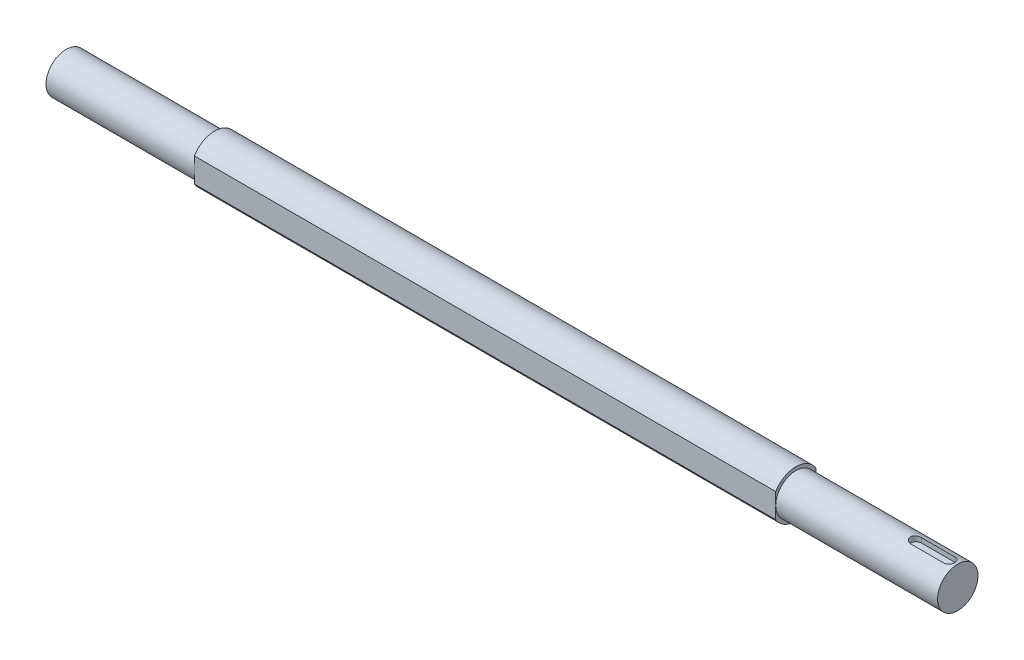
ISO-10303-21;
HEADER;
FILE_DESCRIPTION(('STEP AP214'),'2;1');
FILE_NAME('part.step','',(''),(''),'','','');
FILE_SCHEMA(('AUTOMOTIVE_DESIGN { 1 0 10303 214 1 1 1 1 }'));
ENDSEC;
DATA;
#1=APPLICATION_CONTEXT('core data for automotive mechanical design processes');
#2=APPLICATION_PROTOCOL_DEFINITION('international standard','automotive_design',2000,#1);
#3=PRODUCT_CONTEXT('',#1,'mechanical');
#4=PRODUCT('Part','Part','',(#3));
#5=PRODUCT_RELATED_PRODUCT_CATEGORY('part','',(#4));
#6=PRODUCT_DEFINITION_FORMATION('','',#4);
#7=PRODUCT_DEFINITION_CONTEXT('part definition',#1,'design');
#8=PRODUCT_DEFINITION('design','',#6,#7);
#9=PRODUCT_DEFINITION_SHAPE('','',#8);
#10=(LENGTH_UNIT() NAMED_UNIT(*) SI_UNIT(.MILLI.,.METRE.));
#11=(NAMED_UNIT(*) PLANE_ANGLE_UNIT() SI_UNIT($,.RADIAN.));
#12=(NAMED_UNIT(*) SI_UNIT($,.STERADIAN.) SOLID_ANGLE_UNIT());
#13=UNCERTAINTY_MEASURE_WITH_UNIT(LENGTH_MEASURE(1.E-05),#10,'distance_accuracy_value','');
#14=(GEOMETRIC_REPRESENTATION_CONTEXT(3) GLOBAL_UNCERTAINTY_ASSIGNED_CONTEXT((#13)) GLOBAL_UNIT_ASSIGNED_CONTEXT((#10,
#11,#12)) REPRESENTATION_CONTEXT('',''));
#15=CARTESIAN_POINT('',(0.,0.,0.));
#16=DIRECTION('',(0.,0.,1.));
#17=DIRECTION('',(1.,0.,0.));
#18=AXIS2_PLACEMENT_3D('',#15,#16,#17);
#19=CARTESIAN_POINT('',(210.5,17.5,0.));
#20=DIRECTION('',(-1.,0.,0.));
#21=DIRECTION('',(0.,-1.,0.));
#22=AXIS2_PLACEMENT_3D('',#19,#20,#21);
#23=PLANE('',#22);
#24=CARTESIAN_POINT('',(210.5,-4.54588467470177E-13,0.));
#25=DIRECTION('',(-1.,0.,0.));
#26=DIRECTION('',(0.,-1.,0.));
#27=AXIS2_PLACEMENT_3D('',#24,#25,#26);
#28=CIRCLE('',#27,17.5000000000004);
#29=CARTESIAN_POINT('',(210.5,-9.0138781886603,-15.0000000000004));
#30=VERTEX_POINT('',#29);
#31=CARTESIAN_POINT('',(210.5,-9.0138781886603,15.0000000000004));
#32=VERTEX_POINT('',#31);
#33=EDGE_CURVE('E174',#30,#32,#28,.T.);
#34=ORIENTED_EDGE('',*,*,#33,.F.);
#35=DIRECTION('',(0.,-1.,0.));
#36=VECTOR('',#35,1.);
#37=CARTESIAN_POINT('',(210.5,9.01387818866028,-15.0000000000004));
#38=LINE('',#37,#36);
#39=CARTESIAN_POINT('',(210.5,-4.54497550705923E-13,-15.0000000000004));
#40=VERTEX_POINT('',#39);
#41=EDGE_CURVE('E149',#40,#30,#38,.T.);
#42=ORIENTED_EDGE('',*,*,#41,.F.);
#43=CARTESIAN_POINT('',(210.5,-4.54588467470177E-13,0.));
#44=DIRECTION('',(-1.,0.,0.));
#45=DIRECTION('',(0.,-1.,0.));
#46=AXIS2_PLACEMENT_3D('',#43,#44,#45);
#47=CIRCLE('',#46,15.0000000000005);
#48=CARTESIAN_POINT('',(210.5,-4.54497550705923E-13,15.0000000000004));
#49=VERTEX_POINT('',#48);
#50=EDGE_CURVE('E182',#40,#49,#47,.T.);
#51=ORIENTED_EDGE('',*,*,#50,.T.);
#52=DIRECTION('',(0.,1.,0.));
#53=VECTOR('',#52,1.);
#54=CARTESIAN_POINT('',(210.5,9.01387818866028,15.0000000000004));
#55=LINE('',#54,#53);
#56=EDGE_CURVE('E162',#32,#49,#55,.T.);
#57=ORIENTED_EDGE('',*,*,#56,.F.);
#58=EDGE_LOOP('',(#34,#42,#51,#57));
#59=FACE_BOUND('',#58,.T.);
#60=ADVANCED_FACE('F34',(#59),#23,.F.);
#61=CARTESIAN_POINT('',(-330.5,-4.7960839028905E-13,0.));
#62=DIRECTION('',(-1.,0.,0.));
#63=DIRECTION('',(0.,-1.,0.));
#64=AXIS2_PLACEMENT_3D('',#61,#62,#63);
#65=CYLINDRICAL_SURFACE('',#64,17.5000000000005);
#66=CARTESIAN_POINT('',(210.5,9.01387818866028,15.0000000000004));
#67=VERTEX_POINT('',#66);
#68=CARTESIAN_POINT('',(210.5,9.01387818866028,-15.0000000000004));
#69=VERTEX_POINT('',#68);
#70=EDGE_CURVE('E177',#67,#69,#28,.T.);
#71=ORIENTED_EDGE('',*,*,#70,.T.);
#72=DIRECTION('',(-1.,0.,0.));
#73=VECTOR('',#72,1.);
#74=CARTESIAN_POINT('',(228.700274723202,9.01387818866028,-15.0000000000004));
#75=LINE('',#74,#73);
#76=CARTESIAN_POINT('',(-220.5,9.01387818866028,-15.0000000000004));
#77=VERTEX_POINT('',#76);
#78=EDGE_CURVE('E146',#69,#77,#75,.T.);
#79=ORIENTED_EDGE('',*,*,#78,.T.);
#80=CARTESIAN_POINT('',(-220.5,-4.74521160141035E-13,0.));
#81=DIRECTION('',(-1.,0.,0.));
#82=DIRECTION('',(0.,-1.,0.));
#83=AXIS2_PLACEMENT_3D('',#80,#81,#82);
#84=CIRCLE('',#83,17.5000000000005);
#85=CARTESIAN_POINT('',(-220.5,9.01387818865976,15.0000000000004));
#86=VERTEX_POINT('',#85);
#87=EDGE_CURVE('E173',#86,#77,#84,.T.);
#88=ORIENTED_EDGE('',*,*,#87,.F.);
#89=DIRECTION('',(-1.,0.,0.));
#90=VECTOR('',#89,1.);
#91=CARTESIAN_POINT('',(228.700274723202,9.01387818866028,15.0000000000004));
#92=LINE('',#91,#90);
#93=EDGE_CURVE('E156',#67,#86,#92,.T.);
#94=ORIENTED_EDGE('',*,*,#93,.F.);
#95=EDGE_LOOP('',(#71,#79,#88,#94));
#96=FACE_BOUND('',#95,.T.);
#97=ADVANCED_FACE('F237',(#96),#65,.T.);
#98=CARTESIAN_POINT('',(-220.5,15.0000000000001,0.));
#99=DIRECTION('',(1.,0.,0.));
#100=DIRECTION('',(0.,1.,0.));
#101=AXIS2_PLACEMENT_3D('',#98,#99,#100);
#102=PLANE('',#101);
#103=ORIENTED_EDGE('',*,*,#87,.T.);
#104=DIRECTION('',(0.,1.,0.));
#105=VECTOR('',#104,1.);
#106=CARTESIAN_POINT('',(-220.5,9.01387818866028,-15.0000000000004));
#107=LINE('',#106,#105);
#108=CARTESIAN_POINT('',(-220.5,-4.74521160141035E-13,-15.0000000000004));
#109=VERTEX_POINT('',#108);
#110=EDGE_CURVE('E145',#109,#77,#107,.T.);
#111=ORIENTED_EDGE('',*,*,#110,.F.);
#112=CARTESIAN_POINT('',(-220.5,-4.74521160141035E-13,0.));
#113=DIRECTION('',(-1.,0.,0.));
#114=DIRECTION('',(0.,-1.,0.));
#115=AXIS2_PLACEMENT_3D('',#112,#113,#114);
#116=CIRCLE('',#115,15.0000000000006);
#117=CARTESIAN_POINT('',(-220.5,-4.74521160141035E-13,15.0000000000004));
#118=VERTEX_POINT('',#117);
#119=EDGE_CURVE('E167',#118,#109,#116,.T.);
#120=ORIENTED_EDGE('',*,*,#119,.F.);
#121=DIRECTION('',(0.,-1.,0.));
#122=VECTOR('',#121,1.);
#123=CARTESIAN_POINT('',(-220.5,9.01387818866028,15.0000000000004));
#124=LINE('',#123,#122);
#125=EDGE_CURVE('E154',#86,#118,#124,.T.);
#126=ORIENTED_EDGE('',*,*,#125,.F.);
#127=EDGE_LOOP('',(#103,#111,#120,#126));
#128=FACE_BOUND('',#127,.T.);
#129=ADVANCED_FACE('F233',(#128),#102,.F.);
#130=CARTESIAN_POINT('',(330.5,15.0000000000001,0.));
#131=DIRECTION('',(-1.,0.,0.));
#132=DIRECTION('',(0.,-1.,0.));
#133=AXIS2_PLACEMENT_3D('',#130,#131,#132);
#134=PLANE('',#133);
#135=CARTESIAN_POINT('',(330.5,-4.49038761854161E-13,0.));
#136=DIRECTION('',(-1.,0.,0.));
#137=DIRECTION('',(0.,-1.,0.));
#138=AXIS2_PLACEMENT_3D('',#135,#136,#137);
#139=CIRCLE('',#138,15.0000000000006);
#140=CARTESIAN_POINT('',(330.5,-15.000000000001,0.));
#141=VERTEX_POINT('',#140);
#142=EDGE_CURVE('E181',#141,#141,#139,.T.);
#143=ORIENTED_EDGE('',*,*,#142,.F.);
#144=EDGE_LOOP('',(#143));
#145=FACE_BOUND('',#144,.T.);
#146=ADVANCED_FACE('F36',(#145),#134,.F.);
#147=CARTESIAN_POINT('',(-330.5,-4.7960839028905E-13,0.));
#148=DIRECTION('',(-1.,0.,0.));
#149=DIRECTION('',(0.,-1.,0.));
#150=AXIS2_PLACEMENT_3D('',#147,#148,#149);
#151=CYLINDRICAL_SURFACE('',#150,15.0000000000005);
#152=DIRECTION('',(-1.,0.,0.));
#153=VECTOR('',#152,1.);
#154=CARTESIAN_POINT('',(-330.5,14.456832294801,4.00000000000014));
#155=LINE('',#154,#153);
#156=CARTESIAN_POINT('',(324.5,14.456832294801,4.));
#157=VERTEX_POINT('',#156);
#158=CARTESIAN_POINT('',(299.5,14.4568322948011,4.00000000000001));
#159=VERTEX_POINT('',#158);
#160=EDGE_CURVE('E11',#157,#159,#155,.T.);
#161=ORIENTED_EDGE('',*,*,#160,.T.);
#162=CARTESIAN_POINT('',(299.5,14.4568322948011,4.00000000000001));
#163=CARTESIAN_POINT('',(299.389641756596,14.4568189842468,4.00001309389175));
#164=CARTESIAN_POINT('',(299.279291478007,14.4580956467718,3.99543311151604));
#165=CARTESIAN_POINT('',(299.059421346034,14.4631301353518,3.97718874589726));
#166=CARTESIAN_POINT('',(298.94990134224,14.466887500596,3.96352604983924));
#167=CARTESIAN_POINT('',(298.732698346486,14.476774044106,3.92725695741263));
#168=CARTESIAN_POINT('',(298.625011912152,14.4828981072581,3.90466984692446));
#169=CARTESIAN_POINT('',(298.412025139644,14.4973231400468,3.85076543838184));
#170=CARTESIAN_POINT('',(298.306724843415,14.5056241479175,3.81944798699437));
#171=CARTESIAN_POINT('',(297.995536581225,14.5334412456828,3.71275643853687));
#172=CARTESIAN_POINT('',(297.794125066453,14.5558829598253,3.62460332607937));
#173=CARTESIAN_POINT('',(297.408979240374,14.6060171290378,3.41695780475822));
#174=CARTESIAN_POINT('',(297.225250796028,14.6337113178036,3.29745504324308));
#175=CARTESIAN_POINT('',(296.876029423072,14.6920016406367,3.02730320878009));
#176=CARTESIAN_POINT('',(296.711038159034,14.7226489452443,2.87601544465617));
#177=CARTESIAN_POINT('',(296.408442433038,14.7829523618629,2.54795832924026));
#178=CARTESIAN_POINT('',(296.270842417132,14.8126083123118,2.37118484921247));
#179=CARTESIAN_POINT('',(296.024827869814,14.8681604116922,1.99367199592154));
#180=CARTESIAN_POINT('',(295.916916034422,14.8939887414058,1.79259414843394));
#181=CARTESIAN_POINT('',(295.736627111039,14.9383834129137,1.37435575552788));
#182=CARTESIAN_POINT('',(295.664242355223,14.9569513215519,1.15719869214846));
#183=CARTESIAN_POINT('',(295.558690174831,14.9843709217853,0.718234307369676));
#184=CARTESIAN_POINT('',(295.524662787106,14.9934353394138,0.496647293428109));
#185=CARTESIAN_POINT('',(295.494085686777,15.0015705103633,0.0507319917605788));
#186=CARTESIAN_POINT('',(295.497530515807,15.0006427191927,-0.173595891963454));
#187=CARTESIAN_POINT('',(295.541195686368,14.9890534931377,-0.612629502642166));
#188=CARTESIAN_POINT('',(295.580486127656,14.9786381919444,-0.827435206418317));
#189=CARTESIAN_POINT('',(295.693225150863,14.9495347795913,-1.24728467665104));
#190=CARTESIAN_POINT('',(295.766675352151,14.9308462762365,-1.45232797980575));
#191=CARTESIAN_POINT('',(295.946359966253,14.8869312076946,-1.84920963545356));
#192=CARTESIAN_POINT('',(296.05291337223,14.8616414267934,-2.04089626466617));
#193=CARTESIAN_POINT('',(296.295542768965,14.8072486052898,-2.40398441957148));
#194=CARTESIAN_POINT('',(296.431623922183,14.7781448982354,-2.57538239000351));
#195=CARTESIAN_POINT('',(296.734327971101,14.7182294237974,-2.89854935036781));
#196=CARTESIAN_POINT('',(296.901758007894,14.6873926412645,-3.0495572240081));
#197=CARTESIAN_POINT('',(297.260042840709,14.6282716207253,-3.32161448391784));
#198=CARTESIAN_POINT('',(297.450904096481,14.599988090371,-3.4426555807802));
#199=CARTESIAN_POINT('',(297.751353283365,14.5618587427772,-3.59932937334134));
#200=CARTESIAN_POINT('',(297.854288915041,14.5498268172622,-3.64754371945348));
#201=CARTESIAN_POINT('',(298.064046321271,14.5275984074126,-3.73509417643328));
#202=CARTESIAN_POINT('',(298.170866512463,14.5174011851058,-3.77443385857866));
#203=CARTESIAN_POINT('',(298.38751941922,14.4991713081512,-3.84386783810502));
#204=CARTESIAN_POINT('',(298.497348878193,14.4911364080613,-3.87397173088605));
#205=CARTESIAN_POINT('',(298.719275221125,14.4774747012193,-3.92471856960775));
#206=CARTESIAN_POINT('',(298.83137102282,14.4718467722232,-3.9453659249532));
#207=CARTESIAN_POINT('',(299.036251024718,14.463976133431,-3.97411378733402));
#208=CARTESIAN_POINT('',(299.128796446167,14.4613012625134,-3.98382319960776));
#209=CARTESIAN_POINT('',(299.31422535331,14.4577275048597,-3.99676420153355));
#210=CARTESIAN_POINT('',(299.407108070432,14.456825809226,-4.00000603663183));
#211=CARTESIAN_POINT('',(299.5,14.4568322948011,-4.));
#212=B_SPLINE_CURVE_WITH_KNOTS('',3,(#162,#163,#164,#165,#166,#167,#168,#169,#170,#171,#172,
#173,#174,#175,#176,#177,#178,#179,#180,#181,#182,#183,#184,#185,#186,#187,#188,#189,#190,#191,
#192,#193,#194,#195,#196,#197,#198,#199,#200,#201,#202,#203,#204,#205,#206,#207,#208,#209,#210,
#211),.UNSPECIFIED.,.F.,.F.,(4,2,2,2,2,2,2,2,2,2,2,2,2,2,2,2,2,2,2,2,2,2,2,2,4),(0.,
0.330958670878051,0.66185588076851,0.992041890688623,1.32223370010826,1.98190700187175,
2.64179842357632,3.31649637536152,3.99130375261123,4.67691814590527,5.36238449759351,
6.03215661862344,6.7018311790669,7.35461236515045,8.0074244999636,8.66673340793704,
9.32615767867958,10.0057598785669,10.6855498604333,11.0281077435251,11.3705275300853,
11.7125903499582,12.0544935096115,12.3335333037377,12.6121307120355),.UNSPECIFIED.);
#213=CARTESIAN_POINT('',(299.5,14.4568322948011,-4.));
#214=VERTEX_POINT('',#213);
#215=EDGE_CURVE('E185',#159,#214,#212,.T.);
#216=ORIENTED_EDGE('',*,*,#215,.T.);
#217=DIRECTION('',(-1.,0.,0.));
#218=VECTOR('',#217,1.);
#219=CARTESIAN_POINT('',(-330.5,14.4568322948011,-3.99999999999995));
#220=LINE('',#219,#218);
#221=CARTESIAN_POINT('',(324.5,14.4568322948011,-3.99999999999995));
#222=VERTEX_POINT('',#221);
#223=EDGE_CURVE('E42',#214,#222,#220,.F.);
#224=ORIENTED_EDGE('',*,*,#223,.T.);
#225=CARTESIAN_POINT('',(324.5,14.4568322948011,-4.));
#226=CARTESIAN_POINT('',(324.610358243404,14.4568189842468,-4.00001309389174));
#227=CARTESIAN_POINT('',(324.720708521993,14.4580956467718,-3.99543311151603));
#228=CARTESIAN_POINT('',(324.940578653966,14.4631301353518,-3.97718874589725));
#229=CARTESIAN_POINT('',(325.05009865776,14.466887500596,-3.96352604983923));
#230=CARTESIAN_POINT('',(325.267301653514,14.476774044106,-3.92725695741262));
#231=CARTESIAN_POINT('',(325.374988087848,14.4828981072581,-3.90466984692445));
#232=CARTESIAN_POINT('',(325.587974860356,14.4973231400468,-3.85076543838182));
#233=CARTESIAN_POINT('',(325.693275156585,14.5056241479175,-3.81944798699436));
#234=CARTESIAN_POINT('',(326.004463418775,14.5334412456828,-3.71275643853686));
#235=CARTESIAN_POINT('',(326.205874933547,14.5558829598253,-3.62460332607936));
#236=CARTESIAN_POINT('',(326.591020759626,14.6060171290378,-3.41695780475821));
#237=CARTESIAN_POINT('',(326.774749203972,14.6337113178036,-3.29745504324307));
#238=CARTESIAN_POINT('',(327.123970576928,14.6920016406367,-3.02730320878009));
#239=CARTESIAN_POINT('',(327.288961840966,14.7226489452443,-2.87601544465618));
#240=CARTESIAN_POINT('',(327.591557566962,14.7829523618629,-2.54795832924029));
#241=CARTESIAN_POINT('',(327.729157582868,14.8126083123118,-2.3711848492125));
#242=CARTESIAN_POINT('',(327.975172130185,14.8681604116922,-1.99367199592157));
#243=CARTESIAN_POINT('',(328.083083965578,14.8939887414058,-1.79259414843396));
#244=CARTESIAN_POINT('',(328.263372888961,14.9383834129137,-1.37435575552789));
#245=CARTESIAN_POINT('',(328.335757644777,14.9569513215519,-1.15719869214846));
#246=CARTESIAN_POINT('',(328.441309825169,14.9843709217853,-0.718234307369664));
#247=CARTESIAN_POINT('',(328.475337212894,14.9934353394138,-0.496647293428096));
#248=CARTESIAN_POINT('',(328.505914313223,15.0015705103633,-0.0507319917605669));
#249=CARTESIAN_POINT('',(328.502469484193,15.0006427191927,0.173595891963465));
#250=CARTESIAN_POINT('',(328.458804313632,14.9890534931377,0.612629502642176));
#251=CARTESIAN_POINT('',(328.419513872344,14.9786381919444,0.827435206418327));
#252=CARTESIAN_POINT('',(328.306774849137,14.9495347795913,1.24728467665105));
#253=CARTESIAN_POINT('',(328.233324647849,14.9308462762365,1.45232797980576));
#254=CARTESIAN_POINT('',(328.053640033747,14.8869312076946,1.84920963545356));
#255=CARTESIAN_POINT('',(327.94708662777,14.8616414267934,2.04089626466618));
#256=CARTESIAN_POINT('',(327.704457231035,14.8072486052898,2.40398441957149));
#257=CARTESIAN_POINT('',(327.568376077817,14.7781448982354,2.57538239000352));
#258=CARTESIAN_POINT('',(327.265672028899,14.7182294237974,2.89854935036782));
#259=CARTESIAN_POINT('',(327.098241992106,14.6873926412645,3.0495572240081));
#260=CARTESIAN_POINT('',(326.739957159291,14.6282716207253,3.32161448391784));
#261=CARTESIAN_POINT('',(326.549095903519,14.599988090371,3.44265558078021));
#262=CARTESIAN_POINT('',(326.248646716635,14.5618587427772,3.59932937334134));
#263=CARTESIAN_POINT('',(326.145711084959,14.5498268172622,3.64754371945349));
#264=CARTESIAN_POINT('',(325.935953678729,14.5275984074126,3.73509417643329));
#265=CARTESIAN_POINT('',(325.829133487537,14.5174011851058,3.77443385857866));
#266=CARTESIAN_POINT('',(325.61248058078,14.4991713081512,3.84386783810503));
#267=CARTESIAN_POINT('',(325.502651121807,14.4911364080613,3.87397173088606));
#268=CARTESIAN_POINT('',(325.280724778875,14.4774747012192,3.92471856960776));
#269=CARTESIAN_POINT('',(325.16862897718,14.4718467722232,3.94536592495321));
#270=CARTESIAN_POINT('',(324.963748975282,14.463976133431,3.97411378733403));
#271=CARTESIAN_POINT('',(324.871203553833,14.4613012625134,3.98382319960776));
#272=CARTESIAN_POINT('',(324.68577464669,14.4577275048597,3.99676420153355));
#273=CARTESIAN_POINT('',(324.592891929568,14.456825809226,4.00000603663184));
#274=CARTESIAN_POINT('',(324.5,14.4568322948011,4.));
#275=B_SPLINE_CURVE_WITH_KNOTS('',3,(#225,#226,#227,#228,#229,#230,#231,#232,#233,#234,#235,
#236,#237,#238,#239,#240,#241,#242,#243,#244,#245,#246,#247,#248,#249,#250,#251,#252,#253,#254,
#255,#256,#257,#258,#259,#260,#261,#262,#263,#264,#265,#266,#267,#268,#269,#270,#271,#272,#273,
#274),.UNSPECIFIED.,.F.,.F.,(4,2,2,2,2,2,2,2,2,2,2,2,2,2,2,2,2,2,2,2,2,2,2,2,4),(0.,
0.330958670878051,0.66185588076851,0.99204189068868,1.32223370010826,1.98190700187175,
2.64179842357632,3.31649637536146,3.99130375261115,4.67691814590524,5.36238449759351,
6.03215661862344,6.7018311790669,7.35461236515044,8.00742449996359,8.66673340793704,
9.32615767867958,10.0057598785669,10.6855498604333,11.0281077435251,11.3705275300853,
11.7125903499582,12.0544935096115,12.3335333037377,12.6121307120355),.UNSPECIFIED.);
#276=EDGE_CURVE('E49',#222,#157,#275,.T.);
#277=ORIENTED_EDGE('',*,*,#276,.T.);
#278=EDGE_LOOP('',(#161,#216,#224,#277));
#279=FACE_BOUND('',#278,.T.);
#280=EDGE_CURVE('E178',#49,#40,#47,.T.);
#281=ORIENTED_EDGE('',*,*,#280,.F.);
#282=ORIENTED_EDGE('',*,*,#50,.F.);
#283=EDGE_LOOP('',(#281,#282));
#284=FACE_BOUND('',#283,.T.);
#285=ORIENTED_EDGE('',*,*,#142,.T.);
#286=EDGE_LOOP('',(#285));
#287=FACE_BOUND('',#286,.T.);
#288=ADVANCED_FACE('F198',(#279,#284,#287),#151,.T.);
#289=ORIENTED_EDGE('',*,*,#280,.T.);
#290=EDGE_CURVE('E151',#69,#40,#38,.T.);
#291=ORIENTED_EDGE('',*,*,#290,.F.);
#292=ORIENTED_EDGE('',*,*,#70,.F.);
#293=EDGE_CURVE('E160',#49,#67,#55,.T.);
#294=ORIENTED_EDGE('',*,*,#293,.F.);
#295=EDGE_LOOP('',(#289,#291,#292,#294));
#296=FACE_BOUND('',#295,.T.);
#297=ADVANCED_FACE('F235',(#296),#23,.F.);
#298=CARTESIAN_POINT('',(-220.5,-9.01387818866071,-15.0000000000004));
#299=VERTEX_POINT('',#298);
#300=CARTESIAN_POINT('',(-220.5,-9.0138781886603,15.0000000000004));
#301=VERTEX_POINT('',#300);
#302=EDGE_CURVE('E170',#299,#301,#84,.T.);
#303=ORIENTED_EDGE('',*,*,#302,.F.);
#304=DIRECTION('',(-1.,0.,0.));
#305=VECTOR('',#304,1.);
#306=CARTESIAN_POINT('',(228.700274723202,-9.0138781886603,-15.0000000000004));
#307=LINE('',#306,#305);
#308=EDGE_CURVE('E57',#30,#299,#307,.T.);
#309=ORIENTED_EDGE('',*,*,#308,.F.);
#310=ORIENTED_EDGE('',*,*,#33,.T.);
#311=DIRECTION('',(-1.,0.,0.));
#312=VECTOR('',#311,1.);
#313=CARTESIAN_POINT('',(228.700274723202,-9.0138781886603,15.0000000000004));
#314=LINE('',#313,#312);
#315=EDGE_CURVE('E157',#32,#301,#314,.T.);
#316=ORIENTED_EDGE('',*,*,#315,.T.);
#317=EDGE_LOOP('',(#303,#309,#310,#316));
#318=FACE_BOUND('',#317,.T.);
#319=ADVANCED_FACE('F231',(#318),#65,.T.);
#320=EDGE_CURVE('E166',#109,#118,#116,.T.);
#321=ORIENTED_EDGE('',*,*,#320,.F.);
#322=EDGE_CURVE('E143',#299,#109,#107,.T.);
#323=ORIENTED_EDGE('',*,*,#322,.F.);
#324=ORIENTED_EDGE('',*,*,#302,.T.);
#325=EDGE_CURVE('E138',#118,#301,#124,.T.);
#326=ORIENTED_EDGE('',*,*,#325,.F.);
#327=EDGE_LOOP('',(#321,#323,#324,#326));
#328=FACE_BOUND('',#327,.T.);
#329=ADVANCED_FACE('F227',(#328),#102,.F.);
#330=CARTESIAN_POINT('',(-330.5,-4.7960839028905E-13,0.));
#331=DIRECTION('',(-1.,0.,0.));
#332=DIRECTION('',(0.,-1.,0.));
#333=AXIS2_PLACEMENT_3D('',#330,#331,#332);
#334=CYLINDRICAL_SURFACE('',#333,15.0000000000006);
#335=CARTESIAN_POINT('',(-330.5,-4.7960839028905E-13,0.));
#336=DIRECTION('',(-1.,0.,0.));
#337=DIRECTION('',(0.,-1.,0.));
#338=AXIS2_PLACEMENT_3D('',#335,#336,#337);
#339=CIRCLE('',#338,15.0000000000006);
#340=CARTESIAN_POINT('',(-330.5,-15.0000000000011,0.));
#341=VERTEX_POINT('',#340);
#342=EDGE_CURVE('E153',#341,#341,#339,.T.);
#343=ORIENTED_EDGE('',*,*,#342,.F.);
#344=EDGE_LOOP('',(#343));
#345=FACE_BOUND('',#344,.T.);
#346=ORIENTED_EDGE('',*,*,#119,.T.);
#347=ORIENTED_EDGE('',*,*,#320,.T.);
#348=EDGE_LOOP('',(#346,#347));
#349=FACE_BOUND('',#348,.T.);
#350=ADVANCED_FACE('F223',(#345,#349),#334,.T.);
#351=CARTESIAN_POINT('',(-330.5,-4.7960839028905E-13,0.));
#352=DIRECTION('',(1.,0.,0.));
#353=DIRECTION('',(0.,1.,0.));
#354=AXIS2_PLACEMENT_3D('',#351,#352,#353);
#355=PLANE('',#354);
#356=ORIENTED_EDGE('',*,*,#342,.T.);
#357=EDGE_LOOP('',(#356));
#358=FACE_BOUND('',#357,.T.);
#359=ADVANCED_FACE('F219',(#358),#355,.F.);
#360=CARTESIAN_POINT('',(228.700274723202,9.01387818866028,15.0000000000004));
#361=DIRECTION('',(0.,0.,-1.));
#362=DIRECTION('',(-1.,0.,0.));
#363=AXIS2_PLACEMENT_3D('',#360,#361,#362);
#364=PLANE('',#363);
#365=ORIENTED_EDGE('',*,*,#56,.T.);
#366=ORIENTED_EDGE('',*,*,#293,.T.);
#367=ORIENTED_EDGE('',*,*,#93,.T.);
#368=ORIENTED_EDGE('',*,*,#125,.T.);
#369=ORIENTED_EDGE('',*,*,#325,.T.);
#370=ORIENTED_EDGE('',*,*,#315,.F.);
#371=EDGE_LOOP('',(#365,#366,#367,#368,#369,#370));
#372=FACE_BOUND('',#371,.T.);
#373=ADVANCED_FACE('F216',(#372),#364,.F.);
#374=CARTESIAN_POINT('',(228.700274723202,9.01387818866028,-15.0000000000004));
#375=DIRECTION('',(0.,0.,1.));
#376=DIRECTION('',(1.,0.,0.));
#377=AXIS2_PLACEMENT_3D('',#374,#375,#376);
#378=PLANE('',#377);
#379=ORIENTED_EDGE('',*,*,#290,.T.);
#380=ORIENTED_EDGE('',*,*,#41,.T.);
#381=ORIENTED_EDGE('',*,*,#308,.T.);
#382=ORIENTED_EDGE('',*,*,#322,.T.);
#383=ORIENTED_EDGE('',*,*,#110,.T.);
#384=ORIENTED_EDGE('',*,*,#78,.F.);
#385=EDGE_LOOP('',(#379,#380,#381,#382,#383,#384));
#386=FACE_BOUND('',#385,.T.);
#387=ADVANCED_FACE('F213',(#386),#378,.F.);
#388=CARTESIAN_POINT('',(324.5,11.,0.));
#389=DIRECTION('',(0.,1.,0.));
#390=DIRECTION('',(0.,0.,1.));
#391=AXIS2_PLACEMENT_3D('',#388,#389,#390);
#392=CYLINDRICAL_SURFACE('',#391,4.);
#393=DIRECTION('',(0.,1.,0.));
#394=VECTOR('',#393,1.);
#395=CARTESIAN_POINT('',(324.5,11.,-4.));
#396=LINE('',#395,#394);
#397=CARTESIAN_POINT('',(324.5,11.,-4.));
#398=VERTEX_POINT('',#397);
#399=EDGE_CURVE('E110',#398,#222,#396,.T.);
#400=ORIENTED_EDGE('',*,*,#399,.F.);
#401=CARTESIAN_POINT('',(324.5,11.,0.));
#402=DIRECTION('',(0.,1.,0.));
#403=DIRECTION('',(0.,0.,1.));
#404=AXIS2_PLACEMENT_3D('',#401,#402,#403);
#405=CIRCLE('',#404,4.);
#406=CARTESIAN_POINT('',(324.5,11.,4.));
#407=VERTEX_POINT('',#406);
#408=EDGE_CURVE('E114',#407,#398,#405,.T.);
#409=ORIENTED_EDGE('',*,*,#408,.F.);
#410=DIRECTION('',(0.,1.,0.));
#411=VECTOR('',#410,1.);
#412=CARTESIAN_POINT('',(324.5,11.,4.));
#413=LINE('',#412,#411);
#414=EDGE_CURVE('E136',#407,#157,#413,.T.);
#415=ORIENTED_EDGE('',*,*,#414,.T.);
#416=ORIENTED_EDGE('',*,*,#276,.F.);
#417=EDGE_LOOP('',(#400,#409,#415,#416));
#418=FACE_BOUND('',#417,.T.);
#419=ADVANCED_FACE('F112',(#418),#392,.F.);
#420=CARTESIAN_POINT('',(324.5,11.,4.));
#421=DIRECTION('',(0.,0.,1.));
#422=DIRECTION('',(1.,0.,0.));
#423=AXIS2_PLACEMENT_3D('',#420,#421,#422);
#424=PLANE('',#423);
#425=ORIENTED_EDGE('',*,*,#414,.F.);
#426=DIRECTION('',(1.,0.,0.));
#427=VECTOR('',#426,1.);
#428=CARTESIAN_POINT('',(324.5,11.,4.));
#429=LINE('',#428,#427);
#430=CARTESIAN_POINT('',(299.5,11.,4.00000000000001));
#431=VERTEX_POINT('',#430);
#432=EDGE_CURVE('E119',#431,#407,#429,.T.);
#433=ORIENTED_EDGE('',*,*,#432,.F.);
#434=DIRECTION('',(0.,1.,0.));
#435=VECTOR('',#434,1.);
#436=CARTESIAN_POINT('',(299.5,11.,4.00000000000001));
#437=LINE('',#436,#435);
#438=EDGE_CURVE('E139',#431,#159,#437,.T.);
#439=ORIENTED_EDGE('',*,*,#438,.T.);
#440=ORIENTED_EDGE('',*,*,#160,.F.);
#441=EDGE_LOOP('',(#425,#433,#439,#440));
#442=FACE_BOUND('',#441,.T.);
#443=ADVANCED_FACE('F206',(#442),#424,.F.);
#444=CARTESIAN_POINT('',(299.5,11.,0.));
#445=DIRECTION('',(0.,1.,0.));
#446=DIRECTION('',(0.,0.,1.));
#447=AXIS2_PLACEMENT_3D('',#444,#445,#446);
#448=CYLINDRICAL_SURFACE('',#447,4.);
#449=ORIENTED_EDGE('',*,*,#438,.F.);
#450=CARTESIAN_POINT('',(299.5,11.,0.));
#451=DIRECTION('',(0.,1.,0.));
#452=DIRECTION('',(0.,0.,1.));
#453=AXIS2_PLACEMENT_3D('',#450,#451,#452);
#454=CIRCLE('',#453,4.);
#455=CARTESIAN_POINT('',(299.5,11.,-4.));
#456=VERTEX_POINT('',#455);
#457=EDGE_CURVE('E128',#456,#431,#454,.T.);
#458=ORIENTED_EDGE('',*,*,#457,.F.);
#459=DIRECTION('',(0.,1.,0.));
#460=VECTOR('',#459,1.);
#461=CARTESIAN_POINT('',(299.5,11.,-4.));
#462=LINE('',#461,#460);
#463=EDGE_CURVE('E118',#456,#214,#462,.T.);
#464=ORIENTED_EDGE('',*,*,#463,.T.);
#465=ORIENTED_EDGE('',*,*,#215,.F.);
#466=EDGE_LOOP('',(#449,#458,#464,#465));
#467=FACE_BOUND('',#466,.T.);
#468=ADVANCED_FACE('F201',(#467),#448,.F.);
#469=CARTESIAN_POINT('',(324.5,11.,-4.));
#470=DIRECTION('',(0.,0.,-1.));
#471=DIRECTION('',(-1.,0.,0.));
#472=AXIS2_PLACEMENT_3D('',#469,#470,#471);
#473=PLANE('',#472);
#474=ORIENTED_EDGE('',*,*,#463,.F.);
#475=DIRECTION('',(-1.,0.,0.));
#476=VECTOR('',#475,1.);
#477=CARTESIAN_POINT('',(324.5,11.,-4.));
#478=LINE('',#477,#476);
#479=EDGE_CURVE('E122',#398,#456,#478,.T.);
#480=ORIENTED_EDGE('',*,*,#479,.F.);
#481=ORIENTED_EDGE('',*,*,#399,.T.);
#482=ORIENTED_EDGE('',*,*,#223,.F.);
#483=EDGE_LOOP('',(#474,#480,#481,#482));
#484=FACE_BOUND('',#483,.T.);
#485=ADVANCED_FACE('F123',(#484),#473,.F.);
#486=CARTESIAN_POINT('',(324.5,11.,0.));
#487=DIRECTION('',(0.,1.,0.));
#488=DIRECTION('',(0.,0.,1.));
#489=AXIS2_PLACEMENT_3D('',#486,#487,#488);
#490=PLANE('',#489);
#491=ORIENTED_EDGE('',*,*,#408,.T.);
#492=ORIENTED_EDGE('',*,*,#479,.T.);
#493=ORIENTED_EDGE('',*,*,#457,.T.);
#494=ORIENTED_EDGE('',*,*,#432,.T.);
#495=EDGE_LOOP('',(#491,#492,#493,#494));
#496=FACE_BOUND('',#495,.T.);
#497=ADVANCED_FACE('F130',(#496),#490,.T.);
#498=CLOSED_SHELL('',(#60,#97,#129,#146,#288,#297,#319,#329,#350,#359,#373,#387,#419,#443,#468,
#485,#497));
#499=MANIFOLD_SOLID_BREP('B2',#498);
#500=ADVANCED_BREP_SHAPE_REPRESENTATION('',(#18,#499),#14);
#501=SHAPE_DEFINITION_REPRESENTATION(#9,#500);
ENDSEC;
END-ISO-10303-21;
